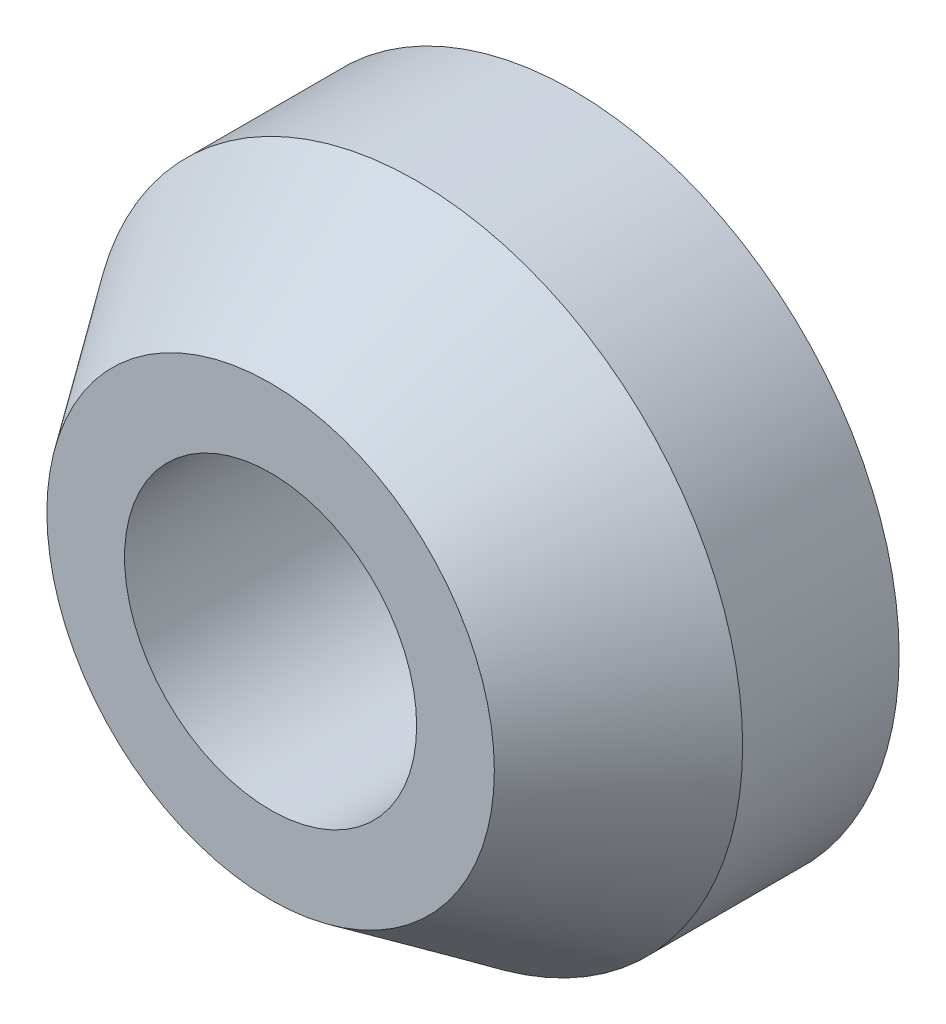
ISO-10303-21;
HEADER;
FILE_DESCRIPTION(('STEP AP214'),'2;1');
FILE_NAME('part.step','',(''),(''),'','','');
FILE_SCHEMA(('AUTOMOTIVE_DESIGN { 1 0 10303 214 1 1 1 1 }'));
ENDSEC;
DATA;
#1=APPLICATION_CONTEXT('core data for automotive mechanical design processes');
#2=APPLICATION_PROTOCOL_DEFINITION('international standard','automotive_design',2000,#1);
#3=PRODUCT_CONTEXT('',#1,'mechanical');
#4=PRODUCT('Part','Part','',(#3));
#5=PRODUCT_RELATED_PRODUCT_CATEGORY('part','',(#4));
#6=PRODUCT_DEFINITION_FORMATION('','',#4);
#7=PRODUCT_DEFINITION_CONTEXT('part definition',#1,'design');
#8=PRODUCT_DEFINITION('design','',#6,#7);
#9=PRODUCT_DEFINITION_SHAPE('','',#8);
#10=(LENGTH_UNIT() NAMED_UNIT(*) SI_UNIT(.MILLI.,.METRE.));
#11=(NAMED_UNIT(*) PLANE_ANGLE_UNIT() SI_UNIT($,.RADIAN.));
#12=(NAMED_UNIT(*) SI_UNIT($,.STERADIAN.) SOLID_ANGLE_UNIT());
#13=UNCERTAINTY_MEASURE_WITH_UNIT(LENGTH_MEASURE(1.E-05),#10,'distance_accuracy_value','');
#14=(GEOMETRIC_REPRESENTATION_CONTEXT(3) GLOBAL_UNCERTAINTY_ASSIGNED_CONTEXT((#13)) GLOBAL_UNIT_ASSIGNED_CONTEXT((#10,
#11,#12)) REPRESENTATION_CONTEXT('',''));
#15=CARTESIAN_POINT('',(0.,0.,0.));
#16=DIRECTION('',(0.,0.,1.));
#17=DIRECTION('',(1.,0.,0.));
#18=AXIS2_PLACEMENT_3D('',#15,#16,#17);
#19=CARTESIAN_POINT('',(0.,0.,2.9464));
#20=DIRECTION('',(0.,0.,-1.));
#21=DIRECTION('',(-1.,0.,0.));
#22=AXIS2_PLACEMENT_3D('',#19,#20,#21);
#23=CYLINDRICAL_SURFACE('',#22,3.175);
#24=CARTESIAN_POINT('',(0.,0.,1.52399999999999));
#25=DIRECTION('',(0.,0.,1.));
#26=DIRECTION('',(1.,0.,0.));
#27=AXIS2_PLACEMENT_3D('',#24,#25,#26);
#28=CIRCLE('',#27,3.175);
#29=CARTESIAN_POINT('',(3.175,0.,1.52399999999999));
#30=VERTEX_POINT('',#29);
#31=EDGE_CURVE('E10',#30,#30,#28,.F.);
#32=ORIENTED_EDGE('',*,*,#31,.T.);
#33=EDGE_LOOP('',(#32));
#34=FACE_BOUND('',#33,.T.);
#35=CARTESIAN_POINT('',(0.,0.,0.));
#36=DIRECTION('',(0.,0.,1.));
#37=DIRECTION('',(1.,0.,0.));
#38=AXIS2_PLACEMENT_3D('',#35,#36,#37);
#39=CIRCLE('',#38,3.175);
#40=CARTESIAN_POINT('',(3.175,0.,0.));
#41=VERTEX_POINT('',#40);
#42=EDGE_CURVE('E41',#41,#41,#39,.T.);
#43=ORIENTED_EDGE('',*,*,#42,.T.);
#44=EDGE_LOOP('',(#43));
#45=FACE_BOUND('',#44,.T.);
#46=ADVANCED_FACE('F30',(#34,#45),#23,.T.);
#47=CARTESIAN_POINT('',(0.,0.,2.9464));
#48=DIRECTION('',(0.,0.,1.));
#49=DIRECTION('',(1.,0.,0.));
#50=AXIS2_PLACEMENT_3D('',#47,#48,#49);
#51=PLANE('',#50);
#52=CARTESIAN_POINT('',(0.,0.,2.9464));
#53=DIRECTION('',(0.,0.,1.));
#54=DIRECTION('',(1.,0.,0.));
#55=AXIS2_PLACEMENT_3D('',#52,#53,#54);
#56=CIRCLE('',#55,2.17902479765051);
#57=CARTESIAN_POINT('',(2.17902479765051,0.,2.9464));
#58=VERTEX_POINT('',#57);
#59=EDGE_CURVE('E37',#58,#58,#56,.T.);
#60=ORIENTED_EDGE('',*,*,#59,.T.);
#61=EDGE_LOOP('',(#60));
#62=FACE_BOUND('',#61,.T.);
#63=CARTESIAN_POINT('',(0.,0.,2.9464));
#64=DIRECTION('',(0.,0.,1.));
#65=DIRECTION('',(1.,0.,0.));
#66=AXIS2_PLACEMENT_3D('',#63,#64,#65);
#67=CIRCLE('',#66,1.4224);
#68=CARTESIAN_POINT('',(1.4224,0.,2.9464));
#69=VERTEX_POINT('',#68);
#70=EDGE_CURVE('E48',#69,#69,#67,.T.);
#71=ORIENTED_EDGE('',*,*,#70,.F.);
#72=EDGE_LOOP('',(#71));
#73=FACE_BOUND('',#72,.T.);
#74=ADVANCED_FACE('F63',(#62,#73),#51,.T.);
#75=CARTESIAN_POINT('',(0.,0.,0.));
#76=DIRECTION('',(0.,0.,1.));
#77=DIRECTION('',(1.,0.,0.));
#78=AXIS2_PLACEMENT_3D('',#75,#76,#77);
#79=PLANE('',#78);
#80=CARTESIAN_POINT('',(0.,0.,0.));
#81=DIRECTION('',(0.,0.,1.));
#82=DIRECTION('',(1.,0.,0.));
#83=AXIS2_PLACEMENT_3D('',#80,#81,#82);
#84=CIRCLE('',#83,1.4224);
#85=CARTESIAN_POINT('',(1.4224,0.,0.));
#86=VERTEX_POINT('',#85);
#87=EDGE_CURVE('E45',#86,#86,#84,.T.);
#88=ORIENTED_EDGE('',*,*,#87,.T.);
#89=EDGE_LOOP('',(#88));
#90=FACE_BOUND('',#89,.T.);
#91=ORIENTED_EDGE('',*,*,#42,.F.);
#92=EDGE_LOOP('',(#91));
#93=FACE_BOUND('',#92,.T.);
#94=ADVANCED_FACE('F54',(#90,#93),#79,.F.);
#95=CARTESIAN_POINT('',(0.,0.,0.));
#96=DIRECTION('',(0.,0.,1.));
#97=DIRECTION('',(1.,0.,0.));
#98=AXIS2_PLACEMENT_3D('',#95,#96,#97);
#99=CYLINDRICAL_SURFACE('',#98,1.4224);
#100=ORIENTED_EDGE('',*,*,#87,.F.);
#101=EDGE_LOOP('',(#100));
#102=FACE_BOUND('',#101,.T.);
#103=ORIENTED_EDGE('',*,*,#70,.T.);
#104=EDGE_LOOP('',(#103));
#105=FACE_BOUND('',#104,.T.);
#106=ADVANCED_FACE('F57',(#102,#105),#99,.F.);
#107=CARTESIAN_POINT('',(0.,0.,2.9464));
#108=DIRECTION('',(0.,0.,-1.));
#109=DIRECTION('',(-1.,0.,0.));
#110=AXIS2_PLACEMENT_3D('',#107,#108,#109);
#111=CONICAL_SURFACE('',#110,2.17902479765051,0.610865238198013);
#112=ORIENTED_EDGE('',*,*,#31,.F.);
#113=EDGE_LOOP('',(#112));
#114=FACE_BOUND('',#113,.T.);
#115=ORIENTED_EDGE('',*,*,#59,.F.);
#116=EDGE_LOOP('',(#115));
#117=FACE_BOUND('',#116,.T.);
#118=ADVANCED_FACE('F32',(#114,#117),#111,.T.);
#119=CLOSED_SHELL('',(#46,#74,#94,#106,#118));
#120=MANIFOLD_SOLID_BREP('B2',#119);
#121=ADVANCED_BREP_SHAPE_REPRESENTATION('',(#18,#120),#14);
#122=SHAPE_DEFINITION_REPRESENTATION(#9,#121);
ENDSEC;
END-ISO-10303-21;
